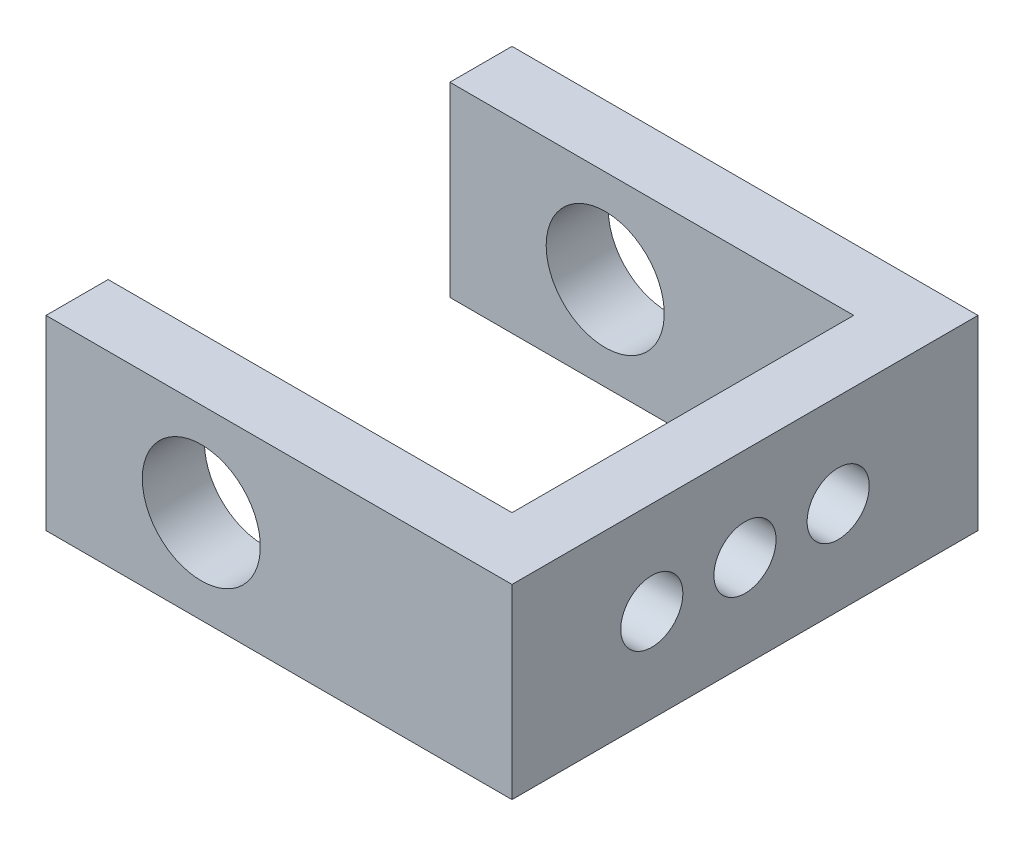
ISO-10303-21;
HEADER;
FILE_DESCRIPTION(('STEP AP214'),'2;1');
FILE_NAME('part.step','',(''),(''),'','','');
FILE_SCHEMA(('AUTOMOTIVE_DESIGN { 1 0 10303 214 1 1 1 1 }'));
ENDSEC;
DATA;
#1=APPLICATION_CONTEXT('core data for automotive mechanical design processes');
#2=APPLICATION_PROTOCOL_DEFINITION('international standard','automotive_design',2000,#1);
#3=PRODUCT_CONTEXT('',#1,'mechanical');
#4=PRODUCT('Part','Part','',(#3));
#5=PRODUCT_RELATED_PRODUCT_CATEGORY('part','',(#4));
#6=PRODUCT_DEFINITION_FORMATION('','',#4);
#7=PRODUCT_DEFINITION_CONTEXT('part definition',#1,'design');
#8=PRODUCT_DEFINITION('design','',#6,#7);
#9=PRODUCT_DEFINITION_SHAPE('','',#8);
#10=(LENGTH_UNIT() NAMED_UNIT(*) SI_UNIT(.MILLI.,.METRE.));
#11=(NAMED_UNIT(*) PLANE_ANGLE_UNIT() SI_UNIT($,.RADIAN.));
#12=(NAMED_UNIT(*) SI_UNIT($,.STERADIAN.) SOLID_ANGLE_UNIT());
#13=UNCERTAINTY_MEASURE_WITH_UNIT(LENGTH_MEASURE(1.E-05),#10,'distance_accuracy_value','');
#14=(GEOMETRIC_REPRESENTATION_CONTEXT(3) GLOBAL_UNCERTAINTY_ASSIGNED_CONTEXT((#13)) GLOBAL_UNIT_ASSIGNED_CONTEXT((#10,
#11,#12)) REPRESENTATION_CONTEXT('',''));
#15=CARTESIAN_POINT('',(0.,0.,0.));
#16=DIRECTION('',(0.,0.,1.));
#17=DIRECTION('',(1.,0.,0.));
#18=AXIS2_PLACEMENT_3D('',#15,#16,#17);
#19=CARTESIAN_POINT('',(-55.7565759783046,30.,15.7489808094968));
#20=DIRECTION('',(1.,0.,0.));
#21=DIRECTION('',(0.,0.,-1.));
#22=AXIS2_PLACEMENT_3D('',#19,#20,#21);
#23=PLANE('',#22);
#24=DIRECTION('',(0.,0.,1.));
#25=VECTOR('',#24,1.);
#26=CARTESIAN_POINT('',(-55.7565759783046,0.,15.7489808094968));
#27=LINE('',#26,#25);
#28=CARTESIAN_POINT('',(-55.7565759783046,0.,15.7489808094968));
#29=VERTEX_POINT('',#28);
#30=CARTESIAN_POINT('',(-55.7565759783046,0.,25.7489808094968));
#31=VERTEX_POINT('',#30);
#32=EDGE_CURVE('E131',#29,#31,#27,.T.);
#33=ORIENTED_EDGE('',*,*,#32,.T.);
#34=DIRECTION('',(0.,-1.,0.));
#35=VECTOR('',#34,1.);
#36=CARTESIAN_POINT('',(-55.7565759783046,30.,25.7489808094968));
#37=LINE('',#36,#35);
#38=CARTESIAN_POINT('',(-55.7565759783046,30.,25.7489808094968));
#39=VERTEX_POINT('',#38);
#40=EDGE_CURVE('E11',#39,#31,#37,.T.);
#41=ORIENTED_EDGE('',*,*,#40,.F.);
#42=DIRECTION('',(0.,0.,1.));
#43=VECTOR('',#42,1.);
#44=CARTESIAN_POINT('',(-55.7565759783046,30.,15.7489808094968));
#45=LINE('',#44,#43);
#46=CARTESIAN_POINT('',(-55.7565759783046,30.,15.7489808094968));
#47=VERTEX_POINT('',#46);
#48=EDGE_CURVE('E146',#47,#39,#45,.T.);
#49=ORIENTED_EDGE('',*,*,#48,.F.);
#50=DIRECTION('',(0.,-1.,0.));
#51=VECTOR('',#50,1.);
#52=CARTESIAN_POINT('',(-55.7565759783046,30.,15.7489808094968));
#53=LINE('',#52,#51);
#54=EDGE_CURVE('E127',#47,#29,#53,.T.);
#55=ORIENTED_EDGE('',*,*,#54,.T.);
#56=EDGE_LOOP('',(#33,#41,#49,#55));
#57=FACE_BOUND('',#56,.T.);
#58=ADVANCED_FACE('F33',(#57),#23,.F.);
#59=CARTESIAN_POINT('',(-55.7565759783046,30.,25.7489808094968));
#60=DIRECTION('',(0.,0.,-1.));
#61=DIRECTION('',(-1.,0.,0.));
#62=AXIS2_PLACEMENT_3D('',#59,#60,#61);
#63=PLANE('',#62);
#64=CARTESIAN_POINT('',(-30.7565759783046,15.,25.7489808094968));
#65=DIRECTION('',(0.,0.,-1.));
#66=DIRECTION('',(-1.,0.,0.));
#67=AXIS2_PLACEMENT_3D('',#64,#65,#66);
#68=CIRCLE('',#67,9.5);
#69=CARTESIAN_POINT('',(-40.2565759783046,15.,25.7489808094968));
#70=VERTEX_POINT('',#69);
#71=EDGE_CURVE('E135',#70,#70,#68,.T.);
#72=ORIENTED_EDGE('',*,*,#71,.T.);
#73=EDGE_LOOP('',(#72));
#74=FACE_BOUND('',#73,.T.);
#75=DIRECTION('',(1.,0.,0.));
#76=VECTOR('',#75,1.);
#77=CARTESIAN_POINT('',(-55.7565759783046,0.,25.7489808094968));
#78=LINE('',#77,#76);
#79=CARTESIAN_POINT('',(19.2434240216954,0.,25.7489808094968));
#80=VERTEX_POINT('',#79);
#81=EDGE_CURVE('E134',#31,#80,#78,.T.);
#82=ORIENTED_EDGE('',*,*,#81,.T.);
#83=DIRECTION('',(0.,-1.,0.));
#84=VECTOR('',#83,1.);
#85=CARTESIAN_POINT('',(19.2434240216954,30.,25.7489808094968));
#86=LINE('',#85,#84);
#87=CARTESIAN_POINT('',(19.2434240216954,30.,25.7489808094968));
#88=VERTEX_POINT('',#87);
#89=EDGE_CURVE('E42',#88,#80,#86,.T.);
#90=ORIENTED_EDGE('',*,*,#89,.F.);
#91=DIRECTION('',(1.,0.,0.));
#92=VECTOR('',#91,1.);
#93=CARTESIAN_POINT('',(-55.7565759783046,30.,25.7489808094968));
#94=LINE('',#93,#92);
#95=EDGE_CURVE('E94',#39,#88,#94,.T.);
#96=ORIENTED_EDGE('',*,*,#95,.F.);
#97=ORIENTED_EDGE('',*,*,#40,.T.);
#98=EDGE_LOOP('',(#82,#90,#96,#97));
#99=FACE_BOUND('',#98,.T.);
#100=ADVANCED_FACE('F223',(#74,#99),#63,.F.);
#101=CARTESIAN_POINT('',(19.2434240216954,30.,25.7489808094968));
#102=DIRECTION('',(-1.,0.,0.));
#103=DIRECTION('',(0.,0.,1.));
#104=AXIS2_PLACEMENT_3D('',#101,#102,#103);
#105=PLANE('',#104);
#106=CARTESIAN_POINT('',(19.2434240216954,15.,3.24898080949678));
#107=DIRECTION('',(1.,0.,0.));
#108=DIRECTION('',(0.,0.,-1.));
#109=AXIS2_PLACEMENT_3D('',#106,#107,#108);
#110=CIRCLE('',#109,4.99999999999999);
#111=CARTESIAN_POINT('',(19.2434240216954,15.,-1.75101919050322));
#112=VERTEX_POINT('',#111);
#113=EDGE_CURVE('E176',#112,#112,#110,.T.);
#114=ORIENTED_EDGE('',*,*,#113,.F.);
#115=EDGE_LOOP('',(#114));
#116=FACE_BOUND('',#115,.T.);
#117=CARTESIAN_POINT('',(19.2434240216954,15.,-11.7510191905032));
#118=DIRECTION('',(1.,0.,0.));
#119=DIRECTION('',(0.,0.,-1.));
#120=AXIS2_PLACEMENT_3D('',#117,#118,#119);
#121=CIRCLE('',#120,4.99999999999999);
#122=CARTESIAN_POINT('',(19.2434240216954,15.,-16.7510191905032));
#123=VERTEX_POINT('',#122);
#124=EDGE_CURVE('E165',#123,#123,#121,.T.);
#125=ORIENTED_EDGE('',*,*,#124,.F.);
#126=EDGE_LOOP('',(#125));
#127=FACE_BOUND('',#126,.T.);
#128=CARTESIAN_POINT('',(19.2434240216954,15.,-26.7510191905032));
#129=DIRECTION('',(1.,0.,0.));
#130=DIRECTION('',(0.,0.,-1.));
#131=AXIS2_PLACEMENT_3D('',#128,#129,#130);
#132=CIRCLE('',#131,4.99999999999999);
#133=CARTESIAN_POINT('',(19.2434240216954,15.,-31.7510191905032));
#134=VERTEX_POINT('',#133);
#135=EDGE_CURVE('E164',#134,#134,#132,.T.);
#136=ORIENTED_EDGE('',*,*,#135,.F.);
#137=EDGE_LOOP('',(#136));
#138=FACE_BOUND('',#137,.T.);
#139=DIRECTION('',(0.,0.,-1.));
#140=VECTOR('',#139,1.);
#141=CARTESIAN_POINT('',(19.2434240216954,0.,25.7489808094968));
#142=LINE('',#141,#140);
#143=CARTESIAN_POINT('',(19.2434240216954,0.,-49.2510191905032));
#144=VERTEX_POINT('',#143);
#145=EDGE_CURVE('E137',#80,#144,#142,.T.);
#146=ORIENTED_EDGE('',*,*,#145,.T.);
#147=DIRECTION('',(0.,-1.,0.));
#148=VECTOR('',#147,1.);
#149=CARTESIAN_POINT('',(19.2434240216954,30.,-49.2510191905032));
#150=LINE('',#149,#148);
#151=CARTESIAN_POINT('',(19.2434240216954,30.,-49.2510191905032));
#152=VERTEX_POINT('',#151);
#153=EDGE_CURVE('E153',#152,#144,#150,.T.);
#154=ORIENTED_EDGE('',*,*,#153,.F.);
#155=DIRECTION('',(0.,0.,-1.));
#156=VECTOR('',#155,1.);
#157=CARTESIAN_POINT('',(19.2434240216954,30.,25.7489808094968));
#158=LINE('',#157,#156);
#159=EDGE_CURVE('E189',#88,#152,#158,.T.);
#160=ORIENTED_EDGE('',*,*,#159,.F.);
#161=ORIENTED_EDGE('',*,*,#89,.T.);
#162=EDGE_LOOP('',(#146,#154,#160,#161));
#163=FACE_BOUND('',#162,.T.);
#164=ADVANCED_FACE('F227',(#116,#127,#138,#163),#105,.F.);
#165=CARTESIAN_POINT('',(19.2434240216954,30.,-49.2510191905032));
#166=DIRECTION('',(0.,0.,1.));
#167=DIRECTION('',(1.,0.,0.));
#168=AXIS2_PLACEMENT_3D('',#165,#166,#167);
#169=PLANE('',#168);
#170=CARTESIAN_POINT('',(-30.7565759783046,15.,-49.2510191905032));
#171=DIRECTION('',(0.,0.,-1.));
#172=DIRECTION('',(-1.,0.,0.));
#173=AXIS2_PLACEMENT_3D('',#170,#171,#172);
#174=CIRCLE('',#173,9.5);
#175=CARTESIAN_POINT('',(-40.2565759783046,15.,-49.2510191905032));
#176=VERTEX_POINT('',#175);
#177=EDGE_CURVE('E161',#176,#176,#174,.T.);
#178=ORIENTED_EDGE('',*,*,#177,.F.);
#179=EDGE_LOOP('',(#178));
#180=FACE_BOUND('',#179,.T.);
#181=DIRECTION('',(-1.,0.,0.));
#182=VECTOR('',#181,1.);
#183=CARTESIAN_POINT('',(19.2434240216954,0.,-49.2510191905032));
#184=LINE('',#183,#182);
#185=CARTESIAN_POINT('',(-55.7565759783046,0.,-49.2510191905032));
#186=VERTEX_POINT('',#185);
#187=EDGE_CURVE('E139',#144,#186,#184,.T.);
#188=ORIENTED_EDGE('',*,*,#187,.T.);
#189=DIRECTION('',(0.,-1.,0.));
#190=VECTOR('',#189,1.);
#191=CARTESIAN_POINT('',(-55.7565759783046,30.,-49.2510191905032));
#192=LINE('',#191,#190);
#193=CARTESIAN_POINT('',(-55.7565759783046,30.,-49.2510191905032));
#194=VERTEX_POINT('',#193);
#195=EDGE_CURVE('E150',#194,#186,#192,.T.);
#196=ORIENTED_EDGE('',*,*,#195,.F.);
#197=DIRECTION('',(-1.,0.,0.));
#198=VECTOR('',#197,1.);
#199=CARTESIAN_POINT('',(19.2434240216954,30.,-49.2510191905032));
#200=LINE('',#199,#198);
#201=EDGE_CURVE('E191',#152,#194,#200,.T.);
#202=ORIENTED_EDGE('',*,*,#201,.F.);
#203=ORIENTED_EDGE('',*,*,#153,.T.);
#204=EDGE_LOOP('',(#188,#196,#202,#203));
#205=FACE_BOUND('',#204,.T.);
#206=ADVANCED_FACE('F197',(#180,#205),#169,.F.);
#207=CARTESIAN_POINT('',(-55.7565759783046,30.,-49.2510191905032));
#208=DIRECTION('',(1.,0.,0.));
#209=DIRECTION('',(0.,0.,-1.));
#210=AXIS2_PLACEMENT_3D('',#207,#208,#209);
#211=PLANE('',#210);
#212=DIRECTION('',(0.,0.,1.));
#213=VECTOR('',#212,1.);
#214=CARTESIAN_POINT('',(-55.7565759783046,0.,-49.2510191905032));
#215=LINE('',#214,#213);
#216=CARTESIAN_POINT('',(-55.7565759783046,0.,-39.2510191905032));
#217=VERTEX_POINT('',#216);
#218=EDGE_CURVE('E141',#186,#217,#215,.T.);
#219=ORIENTED_EDGE('',*,*,#218,.T.);
#220=DIRECTION('',(0.,-1.,0.));
#221=VECTOR('',#220,1.);
#222=CARTESIAN_POINT('',(-55.7565759783046,30.,-39.2510191905032));
#223=LINE('',#222,#221);
#224=CARTESIAN_POINT('',(-55.7565759783046,30.,-39.2510191905032));
#225=VERTEX_POINT('',#224);
#226=EDGE_CURVE('E122',#225,#217,#223,.T.);
#227=ORIENTED_EDGE('',*,*,#226,.F.);
#228=DIRECTION('',(0.,0.,1.));
#229=VECTOR('',#228,1.);
#230=CARTESIAN_POINT('',(-55.7565759783046,30.,-49.2510191905032));
#231=LINE('',#230,#229);
#232=EDGE_CURVE('E113',#194,#225,#231,.T.);
#233=ORIENTED_EDGE('',*,*,#232,.F.);
#234=ORIENTED_EDGE('',*,*,#195,.T.);
#235=EDGE_LOOP('',(#219,#227,#233,#234));
#236=FACE_BOUND('',#235,.T.);
#237=ADVANCED_FACE('F201',(#236),#211,.F.);
#238=CARTESIAN_POINT('',(-55.7565759783046,30.,-39.2510191905032));
#239=DIRECTION('',(0.,0.,-1.));
#240=DIRECTION('',(-1.,0.,0.));
#241=AXIS2_PLACEMENT_3D('',#238,#239,#240);
#242=PLANE('',#241);
#243=CARTESIAN_POINT('',(-30.7565759783046,15.,-39.2510191905032));
#244=DIRECTION('',(0.,0.,-1.));
#245=DIRECTION('',(-1.,0.,0.));
#246=AXIS2_PLACEMENT_3D('',#243,#244,#245);
#247=CIRCLE('',#246,9.5);
#248=CARTESIAN_POINT('',(-40.2565759783046,15.,-39.2510191905032));
#249=VERTEX_POINT('',#248);
#250=EDGE_CURVE('E160',#249,#249,#247,.T.);
#251=ORIENTED_EDGE('',*,*,#250,.T.);
#252=EDGE_LOOP('',(#251));
#253=FACE_BOUND('',#252,.T.);
#254=DIRECTION('',(1.,0.,0.));
#255=VECTOR('',#254,1.);
#256=CARTESIAN_POINT('',(-55.7565759783046,0.,-39.2510191905032));
#257=LINE('',#256,#255);
#258=CARTESIAN_POINT('',(9.24342402169539,0.,-39.2510191905032));
#259=VERTEX_POINT('',#258);
#260=EDGE_CURVE('E121',#217,#259,#257,.T.);
#261=ORIENTED_EDGE('',*,*,#260,.T.);
#262=DIRECTION('',(0.,-1.,0.));
#263=VECTOR('',#262,1.);
#264=CARTESIAN_POINT('',(9.24342402169539,30.,-39.2510191905032));
#265=LINE('',#264,#263);
#266=CARTESIAN_POINT('',(9.24342402169539,30.,-39.2510191905032));
#267=VERTEX_POINT('',#266);
#268=EDGE_CURVE('E118',#267,#259,#265,.T.);
#269=ORIENTED_EDGE('',*,*,#268,.F.);
#270=DIRECTION('',(1.,0.,0.));
#271=VECTOR('',#270,1.);
#272=CARTESIAN_POINT('',(-55.7565759783046,30.,-39.2510191905032));
#273=LINE('',#272,#271);
#274=EDGE_CURVE('E107',#225,#267,#273,.T.);
#275=ORIENTED_EDGE('',*,*,#274,.F.);
#276=ORIENTED_EDGE('',*,*,#226,.T.);
#277=EDGE_LOOP('',(#261,#269,#275,#276));
#278=FACE_BOUND('',#277,.T.);
#279=ADVANCED_FACE('F119',(#253,#278),#242,.F.);
#280=CARTESIAN_POINT('',(9.24342402169539,30.,-39.2510191905032));
#281=DIRECTION('',(1.,0.,0.));
#282=DIRECTION('',(0.,0.,-1.));
#283=AXIS2_PLACEMENT_3D('',#280,#281,#282);
#284=PLANE('',#283);
#285=CARTESIAN_POINT('',(9.2434240216954,15.,3.24898080949678));
#286=DIRECTION('',(1.,0.,0.));
#287=DIRECTION('',(0.,0.,-1.));
#288=AXIS2_PLACEMENT_3D('',#285,#286,#287);
#289=CIRCLE('',#288,4.99999999999999);
#290=CARTESIAN_POINT('',(9.2434240216954,15.,-1.75101919050322));
#291=VERTEX_POINT('',#290);
#292=EDGE_CURVE('E36',#291,#291,#289,.T.);
#293=ORIENTED_EDGE('',*,*,#292,.T.);
#294=EDGE_LOOP('',(#293));
#295=FACE_BOUND('',#294,.T.);
#296=CARTESIAN_POINT('',(9.2434240216954,15.,-11.7510191905032));
#297=DIRECTION('',(1.,0.,0.));
#298=DIRECTION('',(0.,0.,-1.));
#299=AXIS2_PLACEMENT_3D('',#296,#297,#298);
#300=CIRCLE('',#299,4.99999999999999);
#301=CARTESIAN_POINT('',(9.2434240216954,15.,-16.7510191905032));
#302=VERTEX_POINT('',#301);
#303=EDGE_CURVE('E162',#302,#302,#300,.T.);
#304=ORIENTED_EDGE('',*,*,#303,.T.);
#305=EDGE_LOOP('',(#304));
#306=FACE_BOUND('',#305,.T.);
#307=CARTESIAN_POINT('',(9.2434240216954,15.,-26.7510191905032));
#308=DIRECTION('',(1.,0.,0.));
#309=DIRECTION('',(0.,0.,-1.));
#310=AXIS2_PLACEMENT_3D('',#307,#308,#309);
#311=CIRCLE('',#310,4.99999999999999);
#312=CARTESIAN_POINT('',(9.2434240216954,15.,-31.7510191905032));
#313=VERTEX_POINT('',#312);
#314=EDGE_CURVE('E169',#313,#313,#311,.T.);
#315=ORIENTED_EDGE('',*,*,#314,.T.);
#316=EDGE_LOOP('',(#315));
#317=FACE_BOUND('',#316,.T.);
#318=DIRECTION('',(0.,0.,1.));
#319=VECTOR('',#318,1.);
#320=CARTESIAN_POINT('',(9.24342402169539,0.,-39.2510191905032));
#321=LINE('',#320,#319);
#322=CARTESIAN_POINT('',(9.2434240216954,0.,15.7489808094968));
#323=VERTEX_POINT('',#322);
#324=EDGE_CURVE('E80',#259,#323,#321,.T.);
#325=ORIENTED_EDGE('',*,*,#324,.T.);
#326=DIRECTION('',(0.,-1.,0.));
#327=VECTOR('',#326,1.);
#328=CARTESIAN_POINT('',(9.2434240216954,30.,15.7489808094968));
#329=LINE('',#328,#327);
#330=CARTESIAN_POINT('',(9.2434240216954,30.,15.7489808094968));
#331=VERTEX_POINT('',#330);
#332=EDGE_CURVE('E123',#331,#323,#329,.T.);
#333=ORIENTED_EDGE('',*,*,#332,.F.);
#334=DIRECTION('',(0.,0.,1.));
#335=VECTOR('',#334,1.);
#336=CARTESIAN_POINT('',(9.24342402169539,30.,-39.2510191905032));
#337=LINE('',#336,#335);
#338=EDGE_CURVE('E111',#267,#331,#337,.T.);
#339=ORIENTED_EDGE('',*,*,#338,.F.);
#340=ORIENTED_EDGE('',*,*,#268,.T.);
#341=EDGE_LOOP('',(#325,#333,#339,#340));
#342=FACE_BOUND('',#341,.T.);
#343=ADVANCED_FACE('F125',(#295,#306,#317,#342),#284,.F.);
#344=CARTESIAN_POINT('',(9.2434240216954,30.,15.7489808094968));
#345=DIRECTION('',(0.,0.,1.));
#346=DIRECTION('',(1.,0.,0.));
#347=AXIS2_PLACEMENT_3D('',#344,#345,#346);
#348=PLANE('',#347);
#349=CARTESIAN_POINT('',(-30.7565759783046,15.,15.7489808094968));
#350=DIRECTION('',(0.,0.,1.));
#351=DIRECTION('',(1.,0.,0.));
#352=AXIS2_PLACEMENT_3D('',#349,#350,#351);
#353=CIRCLE('',#352,9.5);
#354=CARTESIAN_POINT('',(-21.2565759783046,15.,15.7489808094968));
#355=VERTEX_POINT('',#354);
#356=EDGE_CURVE('E158',#355,#355,#353,.T.);
#357=ORIENTED_EDGE('',*,*,#356,.T.);
#358=EDGE_LOOP('',(#357));
#359=FACE_BOUND('',#358,.T.);
#360=DIRECTION('',(-1.,0.,0.));
#361=VECTOR('',#360,1.);
#362=CARTESIAN_POINT('',(9.2434240216954,0.,15.7489808094968));
#363=LINE('',#362,#361);
#364=EDGE_CURVE('E86',#323,#29,#363,.T.);
#365=ORIENTED_EDGE('',*,*,#364,.T.);
#366=ORIENTED_EDGE('',*,*,#54,.F.);
#367=DIRECTION('',(-1.,0.,0.));
#368=VECTOR('',#367,1.);
#369=CARTESIAN_POINT('',(9.2434240216954,30.,15.7489808094968));
#370=LINE('',#369,#368);
#371=EDGE_CURVE('E51',#331,#47,#370,.T.);
#372=ORIENTED_EDGE('',*,*,#371,.F.);
#373=ORIENTED_EDGE('',*,*,#332,.T.);
#374=EDGE_LOOP('',(#365,#366,#372,#373));
#375=FACE_BOUND('',#374,.T.);
#376=ADVANCED_FACE('F209',(#359,#375),#348,.F.);
#377=CARTESIAN_POINT('',(0.,30.,0.));
#378=DIRECTION('',(0.,1.,0.));
#379=DIRECTION('',(0.,0.,1.));
#380=AXIS2_PLACEMENT_3D('',#377,#378,#379);
#381=PLANE('',#380);
#382=ORIENTED_EDGE('',*,*,#48,.T.);
#383=ORIENTED_EDGE('',*,*,#95,.T.);
#384=ORIENTED_EDGE('',*,*,#159,.T.);
#385=ORIENTED_EDGE('',*,*,#201,.T.);
#386=ORIENTED_EDGE('',*,*,#232,.T.);
#387=ORIENTED_EDGE('',*,*,#274,.T.);
#388=ORIENTED_EDGE('',*,*,#338,.T.);
#389=ORIENTED_EDGE('',*,*,#371,.T.);
#390=EDGE_LOOP('',(#382,#383,#384,#385,#386,#387,#388,#389));
#391=FACE_BOUND('',#390,.T.);
#392=ADVANCED_FACE('F109',(#391),#381,.T.);
#393=CARTESIAN_POINT('',(0.,0.,0.));
#394=DIRECTION('',(0.,1.,0.));
#395=DIRECTION('',(0.,0.,1.));
#396=AXIS2_PLACEMENT_3D('',#393,#394,#395);
#397=PLANE('',#396);
#398=ORIENTED_EDGE('',*,*,#32,.F.);
#399=ORIENTED_EDGE('',*,*,#364,.F.);
#400=ORIENTED_EDGE('',*,*,#324,.F.);
#401=ORIENTED_EDGE('',*,*,#260,.F.);
#402=ORIENTED_EDGE('',*,*,#218,.F.);
#403=ORIENTED_EDGE('',*,*,#187,.F.);
#404=ORIENTED_EDGE('',*,*,#145,.F.);
#405=ORIENTED_EDGE('',*,*,#81,.F.);
#406=EDGE_LOOP('',(#398,#399,#400,#401,#402,#403,#404,#405));
#407=FACE_BOUND('',#406,.T.);
#408=ADVANCED_FACE('F204',(#407),#397,.F.);
#409=CARTESIAN_POINT('',(-30.7565759783046,15.,40.7489808094968));
#410=DIRECTION('',(0.,0.,-1.));
#411=DIRECTION('',(-1.,0.,0.));
#412=AXIS2_PLACEMENT_3D('',#409,#410,#411);
#413=CYLINDRICAL_SURFACE('',#412,9.5);
#414=ORIENTED_EDGE('',*,*,#356,.F.);
#415=EDGE_LOOP('',(#414));
#416=FACE_BOUND('',#415,.T.);
#417=ORIENTED_EDGE('',*,*,#71,.F.);
#418=EDGE_LOOP('',(#417));
#419=FACE_BOUND('',#418,.T.);
#420=ADVANCED_FACE('F250',(#416,#419),#413,.F.);
#421=ORIENTED_EDGE('',*,*,#177,.T.);
#422=EDGE_LOOP('',(#421));
#423=FACE_BOUND('',#422,.T.);
#424=ORIENTED_EDGE('',*,*,#250,.F.);
#425=EDGE_LOOP('',(#424));
#426=FACE_BOUND('',#425,.T.);
#427=ADVANCED_FACE('F247',(#423,#426),#413,.F.);
#428=CARTESIAN_POINT('',(19.2434240216954,15.,-26.7510191905032));
#429=DIRECTION('',(1.,0.,0.));
#430=DIRECTION('',(0.,0.,-1.));
#431=AXIS2_PLACEMENT_3D('',#428,#429,#430);
#432=CYLINDRICAL_SURFACE('',#431,4.99999999999999);
#433=ORIENTED_EDGE('',*,*,#135,.T.);
#434=EDGE_LOOP('',(#433));
#435=FACE_BOUND('',#434,.T.);
#436=ORIENTED_EDGE('',*,*,#314,.F.);
#437=EDGE_LOOP('',(#436));
#438=FACE_BOUND('',#437,.T.);
#439=ADVANCED_FACE('F249',(#435,#438),#432,.F.);
#440=CARTESIAN_POINT('',(19.2434240216954,15.,-11.7510191905032));
#441=DIRECTION('',(1.,0.,0.));
#442=DIRECTION('',(0.,0.,-1.));
#443=AXIS2_PLACEMENT_3D('',#440,#441,#442);
#444=CYLINDRICAL_SURFACE('',#443,4.99999999999999);
#445=ORIENTED_EDGE('',*,*,#124,.T.);
#446=EDGE_LOOP('',(#445));
#447=FACE_BOUND('',#446,.T.);
#448=ORIENTED_EDGE('',*,*,#303,.F.);
#449=EDGE_LOOP('',(#448));
#450=FACE_BOUND('',#449,.T.);
#451=ADVANCED_FACE('F257',(#447,#450),#444,.F.);
#452=CARTESIAN_POINT('',(19.2434240216954,15.,3.24898080949678));
#453=DIRECTION('',(1.,0.,0.));
#454=DIRECTION('',(0.,0.,-1.));
#455=AXIS2_PLACEMENT_3D('',#452,#453,#454);
#456=CYLINDRICAL_SURFACE('',#455,4.99999999999999);
#457=ORIENTED_EDGE('',*,*,#113,.T.);
#458=EDGE_LOOP('',(#457));
#459=FACE_BOUND('',#458,.T.);
#460=ORIENTED_EDGE('',*,*,#292,.F.);
#461=EDGE_LOOP('',(#460));
#462=FACE_BOUND('',#461,.T.);
#463=ADVANCED_FACE('F298',(#459,#462),#456,.F.);
#464=CLOSED_SHELL('',(#58,#100,#164,#206,#237,#279,#343,#376,#392,#408,#420,#427,#439,#451,#463));
#465=MANIFOLD_SOLID_BREP('B2',#464);
#466=ADVANCED_BREP_SHAPE_REPRESENTATION('',(#18,#465),#14);
#467=SHAPE_DEFINITION_REPRESENTATION(#9,#466);
ENDSEC;
END-ISO-10303-21;
